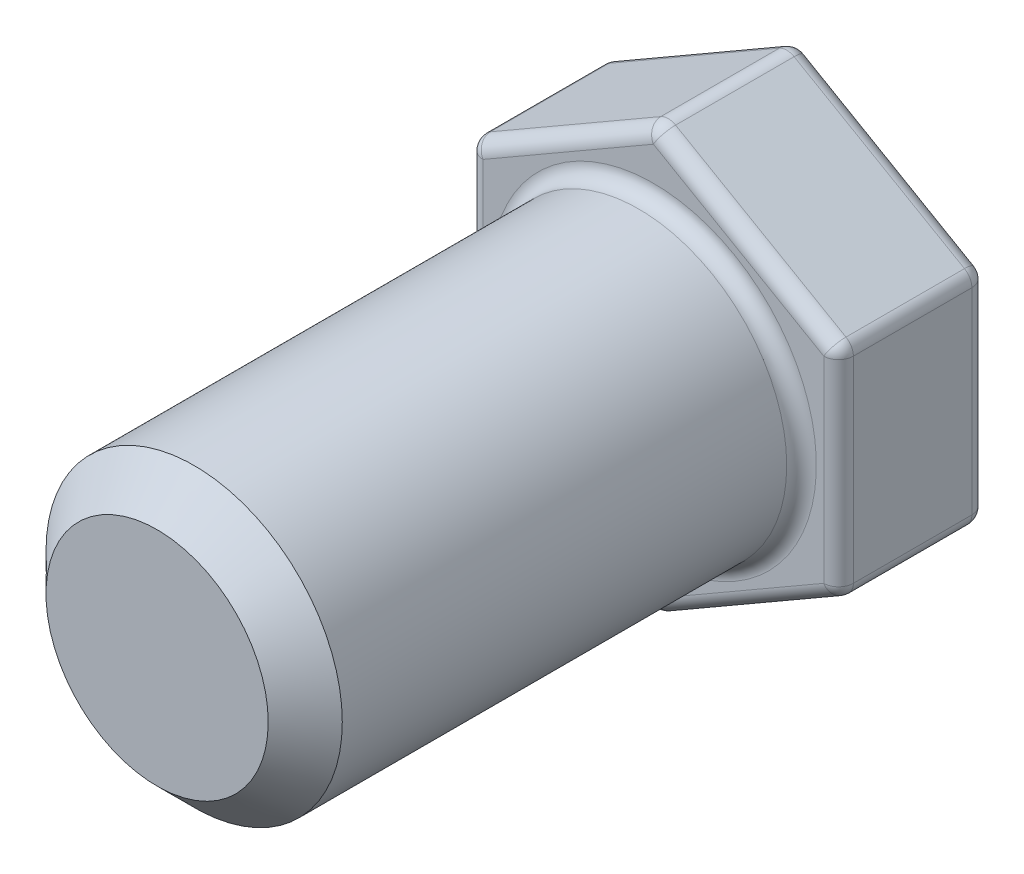
ISO-10303-21;
HEADER;
FILE_DESCRIPTION(('STEP AP214'),'2;1');
FILE_NAME('part.step','',(''),(''),'','','');
FILE_SCHEMA(('AUTOMOTIVE_DESIGN { 1 0 10303 214 1 1 1 1 }'));
ENDSEC;
DATA;
#1=APPLICATION_CONTEXT('core data for automotive mechanical design processes');
#2=APPLICATION_PROTOCOL_DEFINITION('international standard','automotive_design',2000,#1);
#3=PRODUCT_CONTEXT('',#1,'mechanical');
#4=PRODUCT('Part','Part','',(#3));
#5=PRODUCT_RELATED_PRODUCT_CATEGORY('part','',(#4));
#6=PRODUCT_DEFINITION_FORMATION('','',#4);
#7=PRODUCT_DEFINITION_CONTEXT('part definition',#1,'design');
#8=PRODUCT_DEFINITION('design','',#6,#7);
#9=PRODUCT_DEFINITION_SHAPE('','',#8);
#10=(LENGTH_UNIT() NAMED_UNIT(*) SI_UNIT(.MILLI.,.METRE.));
#11=(NAMED_UNIT(*) PLANE_ANGLE_UNIT() SI_UNIT($,.RADIAN.));
#12=(NAMED_UNIT(*) SI_UNIT($,.STERADIAN.) SOLID_ANGLE_UNIT());
#13=UNCERTAINTY_MEASURE_WITH_UNIT(LENGTH_MEASURE(1.E-05),#10,'distance_accuracy_value','');
#14=(GEOMETRIC_REPRESENTATION_CONTEXT(3) GLOBAL_UNCERTAINTY_ASSIGNED_CONTEXT((#13)) GLOBAL_UNIT_ASSIGNED_CONTEXT((#10,
#11,#12)) REPRESENTATION_CONTEXT('',''));
#15=CARTESIAN_POINT('',(0.,0.,0.));
#16=DIRECTION('',(0.,0.,1.));
#17=DIRECTION('',(1.,0.,0.));
#18=AXIS2_PLACEMENT_3D('',#15,#16,#17);
#19=CARTESIAN_POINT('',(0.,0.,6.7));
#20=DIRECTION('',(0.,0.,-1.));
#21=DIRECTION('',(-1.,0.,0.));
#22=AXIS2_PLACEMENT_3D('',#19,#20,#21);
#23=CYLINDRICAL_SURFACE('',#22,2.);
#24=CARTESIAN_POINT('',(0.,0.,6.2));
#25=DIRECTION('',(0.,0.,1.));
#26=DIRECTION('',(1.,0.,0.));
#27=AXIS2_PLACEMENT_3D('',#24,#25,#26);
#28=CIRCLE('',#27,2.);
#29=CARTESIAN_POINT('',(2.,0.,6.2));
#30=VERTEX_POINT('',#29);
#31=EDGE_CURVE('E11',#30,#30,#28,.F.);
#32=ORIENTED_EDGE('',*,*,#31,.T.);
#33=EDGE_LOOP('',(#32));
#34=FACE_BOUND('',#33,.T.);
#35=CARTESIAN_POINT('',(0.,0.,0.2));
#36=DIRECTION('',(0.,0.,-1.));
#37=DIRECTION('',(-1.,0.,0.));
#38=AXIS2_PLACEMENT_3D('',#35,#36,#37);
#39=CIRCLE('',#38,2.);
#40=CARTESIAN_POINT('',(-2.,0.,0.2));
#41=VERTEX_POINT('',#40);
#42=EDGE_CURVE('E290',#41,#41,#39,.F.);
#43=ORIENTED_EDGE('',*,*,#42,.T.);
#44=EDGE_LOOP('',(#43));
#45=FACE_BOUND('',#44,.T.);
#46=ADVANCED_FACE('F40',(#34,#45),#23,.T.);
#47=CARTESIAN_POINT('',(0.,0.,6.7));
#48=DIRECTION('',(0.,0.,1.));
#49=DIRECTION('',(1.,0.,0.));
#50=AXIS2_PLACEMENT_3D('',#47,#48,#49);
#51=PLANE('',#50);
#52=CARTESIAN_POINT('',(0.,0.,6.7));
#53=DIRECTION('',(0.,0.,1.));
#54=DIRECTION('',(1.,0.,0.));
#55=AXIS2_PLACEMENT_3D('',#52,#53,#54);
#56=CIRCLE('',#55,1.5);
#57=CARTESIAN_POINT('',(1.5,0.,6.7));
#58=VERTEX_POINT('',#57);
#59=EDGE_CURVE('E49',#58,#58,#56,.T.);
#60=ORIENTED_EDGE('',*,*,#59,.T.);
#61=EDGE_LOOP('',(#60));
#62=FACE_BOUND('',#61,.T.);
#63=ADVANCED_FACE('F439',(#62),#51,.T.);
#64=CARTESIAN_POINT('',(0.,2.88675134594813,-2.));
#65=DIRECTION('',(-0.500000000000001,-0.866025403784438,0.));
#66=DIRECTION('',(0.866025403784438,-0.500000000000001,0.));
#67=AXIS2_PLACEMENT_3D('',#64,#65,#66);
#68=PLANE('',#67);
#69=DIRECTION('',(0.866025403784438,-0.500000000000001,0.));
#70=VECTOR('',#69,1.);
#71=CARTESIAN_POINT('',(0.,2.88675134594813,-1.8));
#72=LINE('',#71,#70);
#73=CARTESIAN_POINT('',(2.4,1.50111069989303,-1.8));
#74=VERTEX_POINT('',#73);
#75=CARTESIAN_POINT('',(0.100000000000001,2.82901631902917,-1.8));
#76=VERTEX_POINT('',#75);
#77=EDGE_CURVE('E259',#74,#76,#72,.F.);
#78=ORIENTED_EDGE('',*,*,#77,.T.);
#79=DIRECTION('',(0.,0.,1.));
#80=VECTOR('',#79,1.);
#81=CARTESIAN_POINT('',(0.100000000000001,2.82901631902917,-2.));
#82=LINE('',#81,#80);
#83=CARTESIAN_POINT('',(0.100000000000001,2.82901631902917,-0.2));
#84=VERTEX_POINT('',#83);
#85=EDGE_CURVE('E362',#76,#84,#82,.T.);
#86=ORIENTED_EDGE('',*,*,#85,.T.);
#87=DIRECTION('',(0.866025403784438,-0.500000000000001,0.));
#88=VECTOR('',#87,1.);
#89=CARTESIAN_POINT('',(0.,2.88675134594813,-0.2));
#90=LINE('',#89,#88);
#91=CARTESIAN_POINT('',(2.4,1.50111069989303,-0.2));
#92=VERTEX_POINT('',#91);
#93=EDGE_CURVE('E255',#84,#92,#90,.T.);
#94=ORIENTED_EDGE('',*,*,#93,.T.);
#95=DIRECTION('',(0.,0.,1.));
#96=VECTOR('',#95,1.);
#97=CARTESIAN_POINT('',(2.4,1.50111069989303,-2.));
#98=LINE('',#97,#96);
#99=EDGE_CURVE('E359',#92,#74,#98,.F.);
#100=ORIENTED_EDGE('',*,*,#99,.T.);
#101=EDGE_LOOP('',(#78,#86,#94,#100));
#102=FACE_BOUND('',#101,.T.);
#103=ADVANCED_FACE('F457',(#102),#68,.F.);
#104=CARTESIAN_POINT('',(2.5,1.44337567297406,-2.));
#105=DIRECTION('',(-1.,0.,0.));
#106=DIRECTION('',(0.,0.,1.));
#107=AXIS2_PLACEMENT_3D('',#104,#105,#106);
#108=PLANE('',#107);
#109=DIRECTION('',(0.,-1.,0.));
#110=VECTOR('',#109,1.);
#111=CARTESIAN_POINT('',(2.5,1.44337567297406,-0.2));
#112=LINE('',#111,#110);
#113=CARTESIAN_POINT('',(2.5,1.32790561913614,-0.2));
#114=VERTEX_POINT('',#113);
#115=CARTESIAN_POINT('',(2.5,-1.32790561913614,-0.2));
#116=VERTEX_POINT('',#115);
#117=EDGE_CURVE('E249',#114,#116,#112,.T.);
#118=ORIENTED_EDGE('',*,*,#117,.T.);
#119=DIRECTION('',(0.,0.,1.));
#120=VECTOR('',#119,1.);
#121=CARTESIAN_POINT('',(2.5,-1.32790561913614,-2.));
#122=LINE('',#121,#120);
#123=CARTESIAN_POINT('',(2.5,-1.32790561913614,-1.8));
#124=VERTEX_POINT('',#123);
#125=EDGE_CURVE('E391',#116,#124,#122,.F.);
#126=ORIENTED_EDGE('',*,*,#125,.T.);
#127=DIRECTION('',(0.,-1.,0.));
#128=VECTOR('',#127,1.);
#129=CARTESIAN_POINT('',(2.5,1.44337567297406,-1.8));
#130=LINE('',#129,#128);
#131=CARTESIAN_POINT('',(2.5,1.32790561913614,-1.8));
#132=VERTEX_POINT('',#131);
#133=EDGE_CURVE('E252',#124,#132,#130,.F.);
#134=ORIENTED_EDGE('',*,*,#133,.T.);
#135=DIRECTION('',(0.,0.,1.));
#136=VECTOR('',#135,1.);
#137=CARTESIAN_POINT('',(2.5,1.32790561913614,-2.));
#138=LINE('',#137,#136);
#139=EDGE_CURVE('E63',#132,#114,#138,.T.);
#140=ORIENTED_EDGE('',*,*,#139,.T.);
#141=EDGE_LOOP('',(#118,#126,#134,#140));
#142=FACE_BOUND('',#141,.T.);
#143=ADVANCED_FACE('F623',(#142),#108,.F.);
#144=CARTESIAN_POINT('',(2.5,-1.44337567297406,-2.));
#145=DIRECTION('',(-0.5,0.866025403784439,0.));
#146=DIRECTION('',(-0.866025403784439,-0.5,0.));
#147=AXIS2_PLACEMENT_3D('',#144,#145,#146);
#148=PLANE('',#147);
#149=DIRECTION('',(-0.866025403784439,-0.5,0.));
#150=VECTOR('',#149,1.);
#151=CARTESIAN_POINT('',(2.5,-1.44337567297406,-0.2));
#152=LINE('',#151,#150);
#153=CARTESIAN_POINT('',(2.4,-1.50111069989303,-0.2));
#154=VERTEX_POINT('',#153);
#155=CARTESIAN_POINT('',(0.099999999999999,-2.82901631902917,-0.2));
#156=VERTEX_POINT('',#155);
#157=EDGE_CURVE('E241',#154,#156,#152,.T.);
#158=ORIENTED_EDGE('',*,*,#157,.T.);
#159=DIRECTION('',(0.,0.,1.));
#160=VECTOR('',#159,1.);
#161=CARTESIAN_POINT('',(0.1,-2.82901631902917,-2.));
#162=LINE('',#161,#160);
#163=CARTESIAN_POINT('',(0.099999999999999,-2.82901631902917,-1.8));
#164=VERTEX_POINT('',#163);
#165=EDGE_CURVE('E386',#156,#164,#162,.F.);
#166=ORIENTED_EDGE('',*,*,#165,.T.);
#167=DIRECTION('',(-0.866025403784439,-0.5,0.));
#168=VECTOR('',#167,1.);
#169=CARTESIAN_POINT('',(2.5,-1.44337567297406,-1.8));
#170=LINE('',#169,#168);
#171=CARTESIAN_POINT('',(2.4,-1.50111069989303,-1.8));
#172=VERTEX_POINT('',#171);
#173=EDGE_CURVE('E245',#164,#172,#170,.F.);
#174=ORIENTED_EDGE('',*,*,#173,.T.);
#175=DIRECTION('',(0.,0.,1.));
#176=VECTOR('',#175,1.);
#177=CARTESIAN_POINT('',(2.4,-1.50111069989303,-2.));
#178=LINE('',#177,#176);
#179=EDGE_CURVE('E383',#172,#154,#178,.T.);
#180=ORIENTED_EDGE('',*,*,#179,.T.);
#181=EDGE_LOOP('',(#158,#166,#174,#180));
#182=FACE_BOUND('',#181,.T.);
#183=ADVANCED_FACE('F619',(#182),#148,.F.);
#184=CARTESIAN_POINT('',(0.,-2.88675134594813,-2.));
#185=DIRECTION('',(0.5,0.866025403784438,0.));
#186=DIRECTION('',(-0.866025403784438,0.5,0.));
#187=AXIS2_PLACEMENT_3D('',#184,#185,#186);
#188=PLANE('',#187);
#189=DIRECTION('',(-0.866025403784438,0.5,0.));
#190=VECTOR('',#189,1.);
#191=CARTESIAN_POINT('',(0.,-2.88675134594813,-0.2));
#192=LINE('',#191,#190);
#193=CARTESIAN_POINT('',(-0.0999999999999999,-2.82901631902917,-0.2));
#194=VERTEX_POINT('',#193);
#195=CARTESIAN_POINT('',(-2.4,-1.50111069989303,-0.2));
#196=VERTEX_POINT('',#195);
#197=EDGE_CURVE('E233',#194,#196,#192,.T.);
#198=ORIENTED_EDGE('',*,*,#197,.T.);
#199=DIRECTION('',(0.,0.,1.));
#200=VECTOR('',#199,1.);
#201=CARTESIAN_POINT('',(-2.4,-1.50111069989303,-2.));
#202=LINE('',#201,#200);
#203=CARTESIAN_POINT('',(-2.4,-1.50111069989303,-1.8));
#204=VERTEX_POINT('',#203);
#205=EDGE_CURVE('E380',#196,#204,#202,.F.);
#206=ORIENTED_EDGE('',*,*,#205,.T.);
#207=DIRECTION('',(-0.866025403784438,0.5,0.));
#208=VECTOR('',#207,1.);
#209=CARTESIAN_POINT('',(0.,-2.88675134594813,-1.8));
#210=LINE('',#209,#208);
#211=CARTESIAN_POINT('',(-0.0999999999999998,-2.82901631902917,-1.8));
#212=VERTEX_POINT('',#211);
#213=EDGE_CURVE('E237',#204,#212,#210,.F.);
#214=ORIENTED_EDGE('',*,*,#213,.T.);
#215=DIRECTION('',(0.,0.,1.));
#216=VECTOR('',#215,1.);
#217=CARTESIAN_POINT('',(-0.0999999999999999,-2.82901631902917,-2.));
#218=LINE('',#217,#216);
#219=EDGE_CURVE('E377',#212,#194,#218,.T.);
#220=ORIENTED_EDGE('',*,*,#219,.T.);
#221=EDGE_LOOP('',(#198,#206,#214,#220));
#222=FACE_BOUND('',#221,.T.);
#223=ADVANCED_FACE('F613',(#222),#188,.F.);
#224=CARTESIAN_POINT('',(-2.5,-1.44337567297406,-2.));
#225=DIRECTION('',(1.,0.,0.));
#226=DIRECTION('',(0.,1.,0.));
#227=AXIS2_PLACEMENT_3D('',#224,#225,#226);
#228=PLANE('',#227);
#229=DIRECTION('',(0.,1.,0.));
#230=VECTOR('',#229,1.);
#231=CARTESIAN_POINT('',(-2.5,-1.44337567297406,-0.2));
#232=LINE('',#231,#230);
#233=CARTESIAN_POINT('',(-2.5,-1.32790561913614,-0.2));
#234=VERTEX_POINT('',#233);
#235=CARTESIAN_POINT('',(-2.5,1.32790561913614,-0.2));
#236=VERTEX_POINT('',#235);
#237=EDGE_CURVE('E225',#234,#236,#232,.T.);
#238=ORIENTED_EDGE('',*,*,#237,.T.);
#239=DIRECTION('',(0.,0.,1.));
#240=VECTOR('',#239,1.);
#241=CARTESIAN_POINT('',(-2.5,1.32790561913614,-2.));
#242=LINE('',#241,#240);
#243=CARTESIAN_POINT('',(-2.5,1.32790561913614,-1.8));
#244=VERTEX_POINT('',#243);
#245=EDGE_CURVE('E374',#236,#244,#242,.F.);
#246=ORIENTED_EDGE('',*,*,#245,.T.);
#247=DIRECTION('',(0.,1.,0.));
#248=VECTOR('',#247,1.);
#249=CARTESIAN_POINT('',(-2.5,-1.44337567297406,-1.8));
#250=LINE('',#249,#248);
#251=CARTESIAN_POINT('',(-2.5,-1.32790561913614,-1.8));
#252=VERTEX_POINT('',#251);
#253=EDGE_CURVE('E229',#244,#252,#250,.F.);
#254=ORIENTED_EDGE('',*,*,#253,.T.);
#255=DIRECTION('',(0.,0.,1.));
#256=VECTOR('',#255,1.);
#257=CARTESIAN_POINT('',(-2.5,-1.32790561913614,-2.));
#258=LINE('',#257,#256);
#259=EDGE_CURVE('E371',#252,#234,#258,.T.);
#260=ORIENTED_EDGE('',*,*,#259,.T.);
#261=EDGE_LOOP('',(#238,#246,#254,#260));
#262=FACE_BOUND('',#261,.T.);
#263=ADVANCED_FACE('F600',(#262),#228,.F.);
#264=CARTESIAN_POINT('',(-2.5,1.44337567297407,-2.));
#265=DIRECTION('',(0.5,-0.866025403784439,0.));
#266=DIRECTION('',(0.866025403784439,0.5,0.));
#267=AXIS2_PLACEMENT_3D('',#264,#265,#266);
#268=PLANE('',#267);
#269=DIRECTION('',(0.866025403784439,0.5,0.));
#270=VECTOR('',#269,1.);
#271=CARTESIAN_POINT('',(-2.5,1.44337567297407,-0.2));
#272=LINE('',#271,#270);
#273=CARTESIAN_POINT('',(-2.4,1.50111069989303,-0.2));
#274=VERTEX_POINT('',#273);
#275=CARTESIAN_POINT('',(-0.099999999999999,2.82901631902917,-0.2));
#276=VERTEX_POINT('',#275);
#277=EDGE_CURVE('E213',#274,#276,#272,.T.);
#278=ORIENTED_EDGE('',*,*,#277,.T.);
#279=DIRECTION('',(0.,0.,1.));
#280=VECTOR('',#279,1.);
#281=CARTESIAN_POINT('',(-0.0999999999999994,2.82901631902917,-2.));
#282=LINE('',#281,#280);
#283=CARTESIAN_POINT('',(-0.0999999999999985,2.82901631902917,-1.8));
#284=VERTEX_POINT('',#283);
#285=EDGE_CURVE('E368',#276,#284,#282,.F.);
#286=ORIENTED_EDGE('',*,*,#285,.T.);
#287=DIRECTION('',(0.866025403784439,0.5,0.));
#288=VECTOR('',#287,1.);
#289=CARTESIAN_POINT('',(-2.5,1.44337567297407,-1.8));
#290=LINE('',#289,#288);
#291=CARTESIAN_POINT('',(-2.4,1.50111069989303,-1.8));
#292=VERTEX_POINT('',#291);
#293=EDGE_CURVE('E191',#284,#292,#290,.F.);
#294=ORIENTED_EDGE('',*,*,#293,.T.);
#295=DIRECTION('',(0.,0.,1.));
#296=VECTOR('',#295,1.);
#297=CARTESIAN_POINT('',(-2.4,1.50111069989303,-2.));
#298=LINE('',#297,#296);
#299=EDGE_CURVE('E365',#292,#274,#298,.T.);
#300=ORIENTED_EDGE('',*,*,#299,.T.);
#301=EDGE_LOOP('',(#278,#286,#294,#300));
#302=FACE_BOUND('',#301,.T.);
#303=ADVANCED_FACE('F605',(#302),#268,.F.);
#304=CARTESIAN_POINT('',(0.,0.,-2.));
#305=DIRECTION('',(0.,0.,-1.));
#306=DIRECTION('',(-1.,0.,0.));
#307=AXIS2_PLACEMENT_3D('',#304,#305,#306);
#308=PLANE('',#307);
#309=DIRECTION('',(0.,1.,0.));
#310=VECTOR('',#309,1.);
#311=CARTESIAN_POINT('',(-2.3,1.44337567297407,-2.));
#312=LINE('',#311,#310);
#313=CARTESIAN_POINT('',(-2.3,-1.32790561913614,-2.));
#314=VERTEX_POINT('',#313);
#315=CARTESIAN_POINT('',(-2.3,1.32790561913614,-2.));
#316=VERTEX_POINT('',#315);
#317=EDGE_CURVE('E211',#314,#316,#312,.T.);
#318=ORIENTED_EDGE('',*,*,#317,.T.);
#319=DIRECTION('',(0.866025403784439,0.5,0.));
#320=VECTOR('',#319,1.);
#321=CARTESIAN_POINT('',(0.100000000000001,2.71354626519124,-2.));
#322=LINE('',#321,#320);
#323=CARTESIAN_POINT('',(0.,2.65581123827228,-2.));
#324=VERTEX_POINT('',#323);
#325=EDGE_CURVE('E188',#316,#324,#322,.T.);
#326=ORIENTED_EDGE('',*,*,#325,.T.);
#327=DIRECTION('',(0.866025403784438,-0.500000000000001,0.));
#328=VECTOR('',#327,1.);
#329=CARTESIAN_POINT('',(2.4,1.27017059221718,-2.));
#330=LINE('',#329,#328);
#331=CARTESIAN_POINT('',(2.3,1.32790561913614,-2.));
#332=VERTEX_POINT('',#331);
#333=EDGE_CURVE('E197',#324,#332,#330,.T.);
#334=ORIENTED_EDGE('',*,*,#333,.T.);
#335=DIRECTION('',(0.,-1.,0.));
#336=VECTOR('',#335,1.);
#337=CARTESIAN_POINT('',(2.3,-1.44337567297406,-2.));
#338=LINE('',#337,#336);
#339=CARTESIAN_POINT('',(2.3,-1.32790561913614,-2.));
#340=VERTEX_POINT('',#339);
#341=EDGE_CURVE('E204',#332,#340,#338,.T.);
#342=ORIENTED_EDGE('',*,*,#341,.T.);
#343=DIRECTION('',(-0.866025403784439,-0.5,0.));
#344=VECTOR('',#343,1.);
#345=CARTESIAN_POINT('',(-0.1,-2.71354626519124,-2.));
#346=LINE('',#345,#344);
#347=CARTESIAN_POINT('',(0.,-2.65581123827228,-2.));
#348=VERTEX_POINT('',#347);
#349=EDGE_CURVE('E905',#340,#348,#346,.T.);
#350=ORIENTED_EDGE('',*,*,#349,.T.);
#351=DIRECTION('',(-0.866025403784438,0.5,0.));
#352=VECTOR('',#351,1.);
#353=CARTESIAN_POINT('',(-2.4,-1.27017059221718,-2.));
#354=LINE('',#353,#352);
#355=EDGE_CURVE('E219',#348,#314,#354,.T.);
#356=ORIENTED_EDGE('',*,*,#355,.T.);
#357=EDGE_LOOP('',(#318,#326,#334,#342,#350,#356));
#358=FACE_BOUND('',#357,.T.);
#359=ADVANCED_FACE('F208',(#358),#308,.T.);
#360=CARTESIAN_POINT('',(0.,0.,0.));
#361=DIRECTION('',(0.,0.,-1.));
#362=DIRECTION('',(-1.,0.,0.));
#363=AXIS2_PLACEMENT_3D('',#360,#361,#362);
#364=PLANE('',#363);
#365=DIRECTION('',(-0.866025403784439,-0.5,0.));
#366=VECTOR('',#365,1.);
#367=CARTESIAN_POINT('',(1.15,-1.99185842870421,0.));
#368=LINE('',#367,#366);
#369=CARTESIAN_POINT('',(0.,-2.65581123827228,0.));
#370=VERTEX_POINT('',#369);
#371=CARTESIAN_POINT('',(2.3,-1.32790561913614,0.));
#372=VERTEX_POINT('',#371);
#373=EDGE_CURVE('E282',#370,#372,#368,.F.);
#374=ORIENTED_EDGE('',*,*,#373,.T.);
#375=DIRECTION('',(0.,-1.,0.));
#376=VECTOR('',#375,1.);
#377=CARTESIAN_POINT('',(2.3,0.,0.));
#378=LINE('',#377,#376);
#379=CARTESIAN_POINT('',(2.3,1.32790561913614,0.));
#380=VERTEX_POINT('',#379);
#381=EDGE_CURVE('E286',#372,#380,#378,.F.);
#382=ORIENTED_EDGE('',*,*,#381,.T.);
#383=DIRECTION('',(0.866025403784438,-0.500000000000001,0.));
#384=VECTOR('',#383,1.);
#385=CARTESIAN_POINT('',(1.15,1.99185842870421,0.));
#386=LINE('',#385,#384);
#387=CARTESIAN_POINT('',(0.,2.65581123827228,0.));
#388=VERTEX_POINT('',#387);
#389=EDGE_CURVE('E266',#380,#388,#386,.F.);
#390=ORIENTED_EDGE('',*,*,#389,.T.);
#391=DIRECTION('',(0.866025403784439,0.5,0.));
#392=VECTOR('',#391,1.);
#393=CARTESIAN_POINT('',(-1.15,1.99185842870421,0.));
#394=LINE('',#393,#392);
#395=CARTESIAN_POINT('',(-2.3,1.32790561913614,0.));
#396=VERTEX_POINT('',#395);
#397=EDGE_CURVE('E270',#388,#396,#394,.F.);
#398=ORIENTED_EDGE('',*,*,#397,.T.);
#399=DIRECTION('',(0.,1.,0.));
#400=VECTOR('',#399,1.);
#401=CARTESIAN_POINT('',(-2.3,0.,0.));
#402=LINE('',#401,#400);
#403=CARTESIAN_POINT('',(-2.3,-1.32790561913614,0.));
#404=VERTEX_POINT('',#403);
#405=EDGE_CURVE('E274',#396,#404,#402,.F.);
#406=ORIENTED_EDGE('',*,*,#405,.T.);
#407=DIRECTION('',(-0.866025403784438,0.5,0.));
#408=VECTOR('',#407,1.);
#409=CARTESIAN_POINT('',(-1.15,-1.99185842870421,0.));
#410=LINE('',#409,#408);
#411=EDGE_CURVE('E278',#404,#370,#410,.F.);
#412=ORIENTED_EDGE('',*,*,#411,.T.);
#413=EDGE_LOOP('',(#374,#382,#390,#398,#406,#412));
#414=FACE_BOUND('',#413,.T.);
#415=CARTESIAN_POINT('',(0.,0.,0.));
#416=DIRECTION('',(0.,0.,-1.));
#417=DIRECTION('',(-1.,0.,0.));
#418=AXIS2_PLACEMENT_3D('',#415,#416,#417);
#419=CIRCLE('',#418,2.2);
#420=CARTESIAN_POINT('',(-2.2,0.,0.));
#421=VERTEX_POINT('',#420);
#422=EDGE_CURVE('E262',#421,#421,#419,.T.);
#423=ORIENTED_EDGE('',*,*,#422,.T.);
#424=EDGE_LOOP('',(#423));
#425=FACE_BOUND('',#424,.T.);
#426=ADVANCED_FACE('F482',(#414,#425),#364,.F.);
#427=CARTESIAN_POINT('',(1.15,-1.99185842870421,-1.8));
#428=DIRECTION('',(0.866025403784439,0.5,0.));
#429=DIRECTION('',(-0.5,0.866025403784439,0.));
#430=AXIS2_PLACEMENT_3D('',#427,#428,#429);
#431=CYLINDRICAL_SURFACE('',#430,0.2);
#432=ORIENTED_EDGE('',*,*,#173,.F.);
#433=CARTESIAN_POINT('',(0.,-2.65581123827228,-1.8));
#434=DIRECTION('',(0.866025403784439,0.5,0.));
#435=DIRECTION('',(-0.5,0.866025403784439,0.));
#436=AXIS2_PLACEMENT_3D('',#433,#434,#435);
#437=CIRCLE('',#436,0.2);
#438=EDGE_CURVE('E338',#164,#348,#437,.T.);
#439=ORIENTED_EDGE('',*,*,#438,.T.);
#440=ORIENTED_EDGE('',*,*,#349,.F.);
#441=CARTESIAN_POINT('',(2.3,-1.32790561913614,-1.8));
#442=DIRECTION('',(0.866025403784439,0.5,0.));
#443=DIRECTION('',(-0.5,0.866025403784439,0.));
#444=AXIS2_PLACEMENT_3D('',#441,#442,#443);
#445=CIRCLE('',#444,0.2);
#446=EDGE_CURVE('E335',#340,#172,#445,.F.);
#447=ORIENTED_EDGE('',*,*,#446,.T.);
#448=EDGE_LOOP('',(#432,#439,#440,#447));
#449=FACE_BOUND('',#448,.T.);
#450=ADVANCED_FACE('F478',(#449),#431,.T.);
#451=CARTESIAN_POINT('',(-1.15,-1.99185842870421,-1.8));
#452=DIRECTION('',(0.866025403784438,-0.5,0.));
#453=DIRECTION('',(0.5,0.866025403784438,0.));
#454=AXIS2_PLACEMENT_3D('',#451,#452,#453);
#455=CYLINDRICAL_SURFACE('',#454,0.2);
#456=ORIENTED_EDGE('',*,*,#213,.F.);
#457=CARTESIAN_POINT('',(-2.3,-1.32790561913614,-1.8));
#458=DIRECTION('',(0.866025403784438,-0.5,0.));
#459=DIRECTION('',(0.5,0.866025403784438,0.));
#460=AXIS2_PLACEMENT_3D('',#457,#458,#459);
#461=CIRCLE('',#460,0.2);
#462=EDGE_CURVE('E326',#204,#314,#461,.T.);
#463=ORIENTED_EDGE('',*,*,#462,.T.);
#464=ORIENTED_EDGE('',*,*,#355,.F.);
#465=CARTESIAN_POINT('',(0.,-2.65581123827228,-1.8));
#466=DIRECTION('',(0.866025403784438,-0.5,0.));
#467=DIRECTION('',(0.5,0.866025403784438,0.));
#468=AXIS2_PLACEMENT_3D('',#465,#466,#467);
#469=CIRCLE('',#468,0.2);
#470=EDGE_CURVE('E322',#348,#212,#469,.F.);
#471=ORIENTED_EDGE('',*,*,#470,.T.);
#472=EDGE_LOOP('',(#456,#463,#464,#471));
#473=FACE_BOUND('',#472,.T.);
#474=ADVANCED_FACE('F474',(#473),#455,.T.);
#475=CARTESIAN_POINT('',(2.3,0.,-1.8));
#476=DIRECTION('',(0.,1.,0.));
#477=DIRECTION('',(0.,0.,1.));
#478=AXIS2_PLACEMENT_3D('',#475,#476,#477);
#479=CYLINDRICAL_SURFACE('',#478,0.2);
#480=ORIENTED_EDGE('',*,*,#133,.F.);
#481=CARTESIAN_POINT('',(2.3,-1.32790561913614,-1.8));
#482=DIRECTION('',(0.,1.,0.));
#483=DIRECTION('',(0.,0.,1.));
#484=AXIS2_PLACEMENT_3D('',#481,#482,#483);
#485=CIRCLE('',#484,0.2);
#486=EDGE_CURVE('E350',#124,#340,#485,.T.);
#487=ORIENTED_EDGE('',*,*,#486,.T.);
#488=ORIENTED_EDGE('',*,*,#341,.F.);
#489=CARTESIAN_POINT('',(2.3,1.32790561913614,-1.8));
#490=DIRECTION('',(0.,1.,0.));
#491=DIRECTION('',(0.,0.,1.));
#492=AXIS2_PLACEMENT_3D('',#489,#490,#491);
#493=CIRCLE('',#492,0.2);
#494=EDGE_CURVE('E347',#332,#132,#493,.F.);
#495=ORIENTED_EDGE('',*,*,#494,.T.);
#496=EDGE_LOOP('',(#480,#487,#488,#495));
#497=FACE_BOUND('',#496,.T.);
#498=ADVANCED_FACE('F470',(#497),#479,.T.);
#499=CARTESIAN_POINT('',(-2.3,0.,-1.8));
#500=DIRECTION('',(0.,-1.,0.));
#501=DIRECTION('',(1.,0.,0.));
#502=AXIS2_PLACEMENT_3D('',#499,#500,#501);
#503=CYLINDRICAL_SURFACE('',#502,0.2);
#504=ORIENTED_EDGE('',*,*,#253,.F.);
#505=CARTESIAN_POINT('',(-2.3,1.32790561913614,-1.8));
#506=DIRECTION('',(0.,-1.,0.));
#507=DIRECTION('',(1.,0.,0.));
#508=AXIS2_PLACEMENT_3D('',#505,#506,#507);
#509=CIRCLE('',#508,0.2);
#510=EDGE_CURVE('E313',#244,#316,#509,.T.);
#511=ORIENTED_EDGE('',*,*,#510,.T.);
#512=ORIENTED_EDGE('',*,*,#317,.F.);
#513=CARTESIAN_POINT('',(-2.3,-1.32790561913614,-1.8));
#514=DIRECTION('',(0.,-1.,0.));
#515=DIRECTION('',(1.,0.,0.));
#516=AXIS2_PLACEMENT_3D('',#513,#514,#515);
#517=CIRCLE('',#516,0.2);
#518=EDGE_CURVE('E309',#314,#252,#517,.F.);
#519=ORIENTED_EDGE('',*,*,#518,.T.);
#520=EDGE_LOOP('',(#504,#511,#512,#519));
#521=FACE_BOUND('',#520,.T.);
#522=ADVANCED_FACE('F467',(#521),#503,.T.);
#523=CARTESIAN_POINT('',(1.15,1.99185842870421,-1.8));
#524=DIRECTION('',(-0.866025403784438,0.500000000000001,0.));
#525=DIRECTION('',(-0.500000000000001,-0.866025403784438,0.));
#526=AXIS2_PLACEMENT_3D('',#523,#524,#525);
#527=CYLINDRICAL_SURFACE('',#526,0.2);
#528=ORIENTED_EDGE('',*,*,#333,.F.);
#529=CARTESIAN_POINT('',(0.,2.65581123827228,-1.8));
#530=DIRECTION('',(-0.866025403784438,0.500000000000001,0.));
#531=DIRECTION('',(-0.500000000000001,-0.866025403784438,0.));
#532=AXIS2_PLACEMENT_3D('',#529,#530,#531);
#533=CIRCLE('',#532,0.2);
#534=EDGE_CURVE('E168',#324,#76,#533,.F.);
#535=ORIENTED_EDGE('',*,*,#534,.T.);
#536=ORIENTED_EDGE('',*,*,#77,.F.);
#537=CARTESIAN_POINT('',(2.3,1.32790561913614,-1.8));
#538=DIRECTION('',(-0.866025403784438,0.500000000000001,0.));
#539=DIRECTION('',(-0.500000000000001,-0.866025403784438,0.));
#540=AXIS2_PLACEMENT_3D('',#537,#538,#539);
#541=CIRCLE('',#540,0.2);
#542=EDGE_CURVE('E180',#74,#332,#541,.T.);
#543=ORIENTED_EDGE('',*,*,#542,.T.);
#544=EDGE_LOOP('',(#528,#535,#536,#543));
#545=FACE_BOUND('',#544,.T.);
#546=ADVANCED_FACE('F198',(#545),#527,.T.);
#547=CARTESIAN_POINT('',(-1.15,1.99185842870421,-1.8));
#548=DIRECTION('',(-0.866025403784439,-0.5,0.));
#549=DIRECTION('',(0.5,-0.866025403784439,0.));
#550=AXIS2_PLACEMENT_3D('',#547,#548,#549);
#551=CYLINDRICAL_SURFACE('',#550,0.2);
#552=ORIENTED_EDGE('',*,*,#293,.F.);
#553=CARTESIAN_POINT('',(0.,2.65581123827228,-1.8));
#554=DIRECTION('',(-0.866025403784439,-0.5,0.));
#555=DIRECTION('',(0.5,-0.866025403784439,0.));
#556=AXIS2_PLACEMENT_3D('',#553,#554,#555);
#557=CIRCLE('',#556,0.2);
#558=EDGE_CURVE('E171',#284,#324,#557,.T.);
#559=ORIENTED_EDGE('',*,*,#558,.T.);
#560=ORIENTED_EDGE('',*,*,#325,.F.);
#561=CARTESIAN_POINT('',(-2.3,1.32790561913614,-1.8));
#562=DIRECTION('',(-0.866025403784439,-0.5,0.));
#563=DIRECTION('',(0.5,-0.866025403784439,0.));
#564=AXIS2_PLACEMENT_3D('',#561,#562,#563);
#565=CIRCLE('',#564,0.2);
#566=EDGE_CURVE('E193',#316,#292,#565,.F.);
#567=ORIENTED_EDGE('',*,*,#566,.T.);
#568=EDGE_LOOP('',(#552,#559,#560,#567));
#569=FACE_BOUND('',#568,.T.);
#570=ADVANCED_FACE('F185',(#569),#551,.T.);
#571=CARTESIAN_POINT('',(-2.3,-1.44337567297406,-0.2));
#572=DIRECTION('',(0.,1.,0.));
#573=DIRECTION('',(-1.,0.,0.));
#574=AXIS2_PLACEMENT_3D('',#571,#572,#573);
#575=CYLINDRICAL_SURFACE('',#574,0.2);
#576=ORIENTED_EDGE('',*,*,#405,.F.);
#577=CARTESIAN_POINT('',(-2.3,1.32790561913614,-0.2));
#578=DIRECTION('',(0.,1.,0.));
#579=DIRECTION('',(-1.,0.,0.));
#580=AXIS2_PLACEMENT_3D('',#577,#578,#579);
#581=CIRCLE('',#580,0.2);
#582=EDGE_CURVE('E319',#396,#236,#581,.F.);
#583=ORIENTED_EDGE('',*,*,#582,.T.);
#584=ORIENTED_EDGE('',*,*,#237,.F.);
#585=CARTESIAN_POINT('',(-2.3,-1.32790561913614,-0.2));
#586=DIRECTION('',(0.,1.,0.));
#587=DIRECTION('',(-1.,0.,0.));
#588=AXIS2_PLACEMENT_3D('',#585,#586,#587);
#589=CIRCLE('',#588,0.2);
#590=EDGE_CURVE('E316',#234,#404,#589,.T.);
#591=ORIENTED_EDGE('',*,*,#590,.T.);
#592=EDGE_LOOP('',(#576,#583,#584,#591));
#593=FACE_BOUND('',#592,.T.);
#594=ADVANCED_FACE('F464',(#593),#575,.T.);
#595=CARTESIAN_POINT('',(-2.4,1.27017059221718,-0.2));
#596=DIRECTION('',(0.866025403784439,0.5,0.));
#597=DIRECTION('',(-0.5,0.866025403784439,0.));
#598=AXIS2_PLACEMENT_3D('',#595,#596,#597);
#599=CYLINDRICAL_SURFACE('',#598,0.2);
#600=ORIENTED_EDGE('',*,*,#397,.F.);
#601=CARTESIAN_POINT('',(0.,2.65581123827228,-0.2));
#602=DIRECTION('',(0.866025403784439,0.5,0.));
#603=DIRECTION('',(-0.5,0.866025403784439,0.));
#604=AXIS2_PLACEMENT_3D('',#601,#602,#603);
#605=CIRCLE('',#604,0.2);
#606=EDGE_CURVE('E306',#388,#276,#605,.F.);
#607=ORIENTED_EDGE('',*,*,#606,.T.);
#608=ORIENTED_EDGE('',*,*,#277,.F.);
#609=CARTESIAN_POINT('',(-2.3,1.32790561913614,-0.2));
#610=DIRECTION('',(0.866025403784439,0.5,0.));
#611=DIRECTION('',(-0.5,0.866025403784439,0.));
#612=AXIS2_PLACEMENT_3D('',#609,#610,#611);
#613=CIRCLE('',#612,0.2);
#614=EDGE_CURVE('E303',#274,#396,#613,.T.);
#615=ORIENTED_EDGE('',*,*,#614,.T.);
#616=EDGE_LOOP('',(#600,#607,#608,#615));
#617=FACE_BOUND('',#616,.T.);
#618=ADVANCED_FACE('F499',(#617),#599,.T.);
#619=CARTESIAN_POINT('',(0.1,-2.71354626519124,-0.2));
#620=DIRECTION('',(-0.866025403784438,0.5,0.));
#621=DIRECTION('',(-0.5,-0.866025403784438,0.));
#622=AXIS2_PLACEMENT_3D('',#619,#620,#621);
#623=CYLINDRICAL_SURFACE('',#622,0.2);
#624=ORIENTED_EDGE('',*,*,#411,.F.);
#625=CARTESIAN_POINT('',(-2.3,-1.32790561913614,-0.2));
#626=DIRECTION('',(-0.866025403784438,0.5,0.));
#627=DIRECTION('',(-0.5,-0.866025403784438,0.));
#628=AXIS2_PLACEMENT_3D('',#625,#626,#627);
#629=CIRCLE('',#628,0.2);
#630=EDGE_CURVE('E332',#404,#196,#629,.F.);
#631=ORIENTED_EDGE('',*,*,#630,.T.);
#632=ORIENTED_EDGE('',*,*,#197,.F.);
#633=CARTESIAN_POINT('',(0.,-2.65581123827228,-0.2));
#634=DIRECTION('',(-0.866025403784438,0.5,0.));
#635=DIRECTION('',(-0.5,-0.866025403784438,0.));
#636=AXIS2_PLACEMENT_3D('',#633,#634,#635);
#637=CIRCLE('',#636,0.2);
#638=EDGE_CURVE('E329',#194,#370,#637,.T.);
#639=ORIENTED_EDGE('',*,*,#638,.T.);
#640=EDGE_LOOP('',(#624,#631,#632,#639));
#641=FACE_BOUND('',#640,.T.);
#642=ADVANCED_FACE('F495',(#641),#623,.T.);
#643=CARTESIAN_POINT('',(-0.0999999999999993,2.71354626519124,-0.2));
#644=DIRECTION('',(0.866025403784438,-0.500000000000001,0.));
#645=DIRECTION('',(0.500000000000001,0.866025403784438,0.));
#646=AXIS2_PLACEMENT_3D('',#643,#644,#645);
#647=CYLINDRICAL_SURFACE('',#646,0.2);
#648=ORIENTED_EDGE('',*,*,#93,.F.);
#649=CARTESIAN_POINT('',(0.,2.65581123827228,-0.2));
#650=DIRECTION('',(0.866025403784438,-0.500000000000001,0.));
#651=DIRECTION('',(0.500000000000001,0.866025403784438,0.));
#652=AXIS2_PLACEMENT_3D('',#649,#650,#651);
#653=CIRCLE('',#652,0.2);
#654=EDGE_CURVE('E300',#84,#388,#653,.T.);
#655=ORIENTED_EDGE('',*,*,#654,.T.);
#656=ORIENTED_EDGE('',*,*,#389,.F.);
#657=CARTESIAN_POINT('',(2.3,1.32790561913614,-0.2));
#658=DIRECTION('',(0.866025403784438,-0.500000000000001,0.));
#659=DIRECTION('',(0.500000000000001,0.866025403784438,0.));
#660=AXIS2_PLACEMENT_3D('',#657,#658,#659);
#661=CIRCLE('',#660,0.2);
#662=EDGE_CURVE('E179',#380,#92,#661,.F.);
#663=ORIENTED_EDGE('',*,*,#662,.T.);
#664=EDGE_LOOP('',(#648,#655,#656,#663));
#665=FACE_BOUND('',#664,.T.);
#666=ADVANCED_FACE('F491',(#665),#647,.T.);
#667=CARTESIAN_POINT('',(2.4,-1.27017059221718,-0.2));
#668=DIRECTION('',(-0.866025403784439,-0.5,0.));
#669=DIRECTION('',(0.5,-0.866025403784439,0.));
#670=AXIS2_PLACEMENT_3D('',#667,#668,#669);
#671=CYLINDRICAL_SURFACE('',#670,0.2);
#672=ORIENTED_EDGE('',*,*,#373,.F.);
#673=CARTESIAN_POINT('',(0.,-2.65581123827228,-0.2));
#674=DIRECTION('',(-0.866025403784439,-0.5,0.));
#675=DIRECTION('',(0.5,-0.866025403784439,0.));
#676=AXIS2_PLACEMENT_3D('',#673,#674,#675);
#677=CIRCLE('',#676,0.2);
#678=EDGE_CURVE('E344',#370,#156,#677,.F.);
#679=ORIENTED_EDGE('',*,*,#678,.T.);
#680=ORIENTED_EDGE('',*,*,#157,.F.);
#681=CARTESIAN_POINT('',(2.3,-1.32790561913614,-0.2));
#682=DIRECTION('',(-0.866025403784439,-0.5,0.));
#683=DIRECTION('',(0.5,-0.866025403784439,0.));
#684=AXIS2_PLACEMENT_3D('',#681,#682,#683);
#685=CIRCLE('',#684,0.2);
#686=EDGE_CURVE('E341',#154,#372,#685,.T.);
#687=ORIENTED_EDGE('',*,*,#686,.T.);
#688=EDGE_LOOP('',(#672,#679,#680,#687));
#689=FACE_BOUND('',#688,.T.);
#690=ADVANCED_FACE('F488',(#689),#671,.T.);
#691=CARTESIAN_POINT('',(2.3,1.44337567297406,-0.2));
#692=DIRECTION('',(0.,-1.,0.));
#693=DIRECTION('',(0.,0.,-1.));
#694=AXIS2_PLACEMENT_3D('',#691,#692,#693);
#695=CYLINDRICAL_SURFACE('',#694,0.2);
#696=ORIENTED_EDGE('',*,*,#381,.F.);
#697=CARTESIAN_POINT('',(2.3,-1.32790561913614,-0.2));
#698=DIRECTION('',(0.,-1.,0.));
#699=DIRECTION('',(0.,0.,-1.));
#700=AXIS2_PLACEMENT_3D('',#697,#698,#699);
#701=CIRCLE('',#700,0.2);
#702=EDGE_CURVE('E56',#372,#116,#701,.F.);
#703=ORIENTED_EDGE('',*,*,#702,.T.);
#704=ORIENTED_EDGE('',*,*,#117,.F.);
#705=CARTESIAN_POINT('',(2.3,1.32790561913614,-0.2));
#706=DIRECTION('',(0.,-1.,0.));
#707=DIRECTION('',(0.,0.,-1.));
#708=AXIS2_PLACEMENT_3D('',#705,#706,#707);
#709=CIRCLE('',#708,0.2);
#710=EDGE_CURVE('E354',#114,#380,#709,.T.);
#711=ORIENTED_EDGE('',*,*,#710,.T.);
#712=EDGE_LOOP('',(#696,#703,#704,#711));
#713=FACE_BOUND('',#712,.T.);
#714=ADVANCED_FACE('F484',(#713),#695,.T.);
#715=CARTESIAN_POINT('',(0.,0.,0.2));
#716=DIRECTION('',(0.,0.,-1.));
#717=DIRECTION('',(-1.,0.,0.));
#718=AXIS2_PLACEMENT_3D('',#715,#716,#717);
#719=TOROIDAL_SURFACE('',#718,2.2,0.2);
#720=ORIENTED_EDGE('',*,*,#422,.F.);
#721=EDGE_LOOP('',(#720));
#722=FACE_BOUND('',#721,.T.);
#723=ORIENTED_EDGE('',*,*,#42,.F.);
#724=EDGE_LOOP('',(#723));
#725=FACE_BOUND('',#724,.T.);
#726=ADVANCED_FACE('F487',(#722,#725),#719,.F.);
#727=CARTESIAN_POINT('',(0.,2.65581123827228,-0.2));
#728=DIRECTION('',(0.,0.,1.));
#729=DIRECTION('',(1.,0.,0.));
#730=AXIS2_PLACEMENT_3D('',#727,#728,#729);
#731=SPHERICAL_SURFACE('',#730,0.2);
#732=ORIENTED_EDGE('',*,*,#606,.F.);
#733=ORIENTED_EDGE('',*,*,#654,.F.);
#734=CARTESIAN_POINT('',(0.,2.65581123827228,-0.2));
#735=DIRECTION('',(0.,0.,-1.));
#736=DIRECTION('',(-1.,0.,0.));
#737=AXIS2_PLACEMENT_3D('',#734,#735,#736);
#738=CIRCLE('',#737,0.2);
#739=EDGE_CURVE('E205',#276,#84,#738,.T.);
#740=ORIENTED_EDGE('',*,*,#739,.F.);
#741=EDGE_LOOP('',(#732,#733,#740));
#742=FACE_BOUND('',#741,.T.);
#743=ADVANCED_FACE('F509',(#742),#731,.T.);
#744=CARTESIAN_POINT('',(0.,2.65581123827228,-2.));
#745=DIRECTION('',(0.,0.,1.));
#746=DIRECTION('',(1.,0.,0.));
#747=AXIS2_PLACEMENT_3D('',#744,#745,#746);
#748=CYLINDRICAL_SURFACE('',#747,0.2);
#749=ORIENTED_EDGE('',*,*,#739,.T.);
#750=ORIENTED_EDGE('',*,*,#85,.F.);
#751=CARTESIAN_POINT('',(0.,2.65581123827228,-1.8));
#752=DIRECTION('',(0.,0.,-1.));
#753=DIRECTION('',(-1.,0.,0.));
#754=AXIS2_PLACEMENT_3D('',#751,#752,#753);
#755=CIRCLE('',#754,0.2);
#756=EDGE_CURVE('E173',#284,#76,#755,.T.);
#757=ORIENTED_EDGE('',*,*,#756,.F.);
#758=ORIENTED_EDGE('',*,*,#285,.F.);
#759=EDGE_LOOP('',(#749,#750,#757,#758));
#760=FACE_BOUND('',#759,.T.);
#761=ADVANCED_FACE('F514',(#760),#748,.T.);
#762=CARTESIAN_POINT('',(0.,2.65581123827228,-1.8));
#763=DIRECTION('',(0.,0.,1.));
#764=DIRECTION('',(1.,0.,0.));
#765=AXIS2_PLACEMENT_3D('',#762,#763,#764);
#766=SPHERICAL_SURFACE('',#765,0.2);
#767=ORIENTED_EDGE('',*,*,#756,.T.);
#768=ORIENTED_EDGE('',*,*,#534,.F.);
#769=ORIENTED_EDGE('',*,*,#558,.F.);
#770=EDGE_LOOP('',(#767,#768,#769));
#771=FACE_BOUND('',#770,.T.);
#772=ADVANCED_FACE('F170',(#771),#766,.T.);
#773=CARTESIAN_POINT('',(-2.3,1.32790561913614,-0.2));
#774=DIRECTION('',(0.,0.,1.));
#775=DIRECTION('',(1.,0.,0.));
#776=AXIS2_PLACEMENT_3D('',#773,#774,#775);
#777=SPHERICAL_SURFACE('',#776,0.2);
#778=ORIENTED_EDGE('',*,*,#582,.F.);
#779=ORIENTED_EDGE('',*,*,#614,.F.);
#780=CARTESIAN_POINT('',(-2.3,1.32790561913614,-0.2));
#781=DIRECTION('',(0.,0.,-1.));
#782=DIRECTION('',(-1.,0.,0.));
#783=AXIS2_PLACEMENT_3D('',#780,#781,#782);
#784=CIRCLE('',#783,0.2);
#785=EDGE_CURVE('E396',#236,#274,#784,.T.);
#786=ORIENTED_EDGE('',*,*,#785,.F.);
#787=EDGE_LOOP('',(#778,#779,#786));
#788=FACE_BOUND('',#787,.T.);
#789=ADVANCED_FACE('F513',(#788),#777,.T.);
#790=CARTESIAN_POINT('',(-2.3,1.32790561913614,-2.));
#791=DIRECTION('',(0.,0.,1.));
#792=DIRECTION('',(1.,0.,0.));
#793=AXIS2_PLACEMENT_3D('',#790,#791,#792);
#794=CYLINDRICAL_SURFACE('',#793,0.2);
#795=ORIENTED_EDGE('',*,*,#785,.T.);
#796=ORIENTED_EDGE('',*,*,#299,.F.);
#797=CARTESIAN_POINT('',(-2.3,1.32790561913614,-1.8));
#798=DIRECTION('',(0.,0.,-1.));
#799=DIRECTION('',(-1.,0.,0.));
#800=AXIS2_PLACEMENT_3D('',#797,#798,#799);
#801=CIRCLE('',#800,0.2);
#802=EDGE_CURVE('E400',#244,#292,#801,.T.);
#803=ORIENTED_EDGE('',*,*,#802,.F.);
#804=ORIENTED_EDGE('',*,*,#245,.F.);
#805=EDGE_LOOP('',(#795,#796,#803,#804));
#806=FACE_BOUND('',#805,.T.);
#807=ADVANCED_FACE('F525',(#806),#794,.T.);
#808=CARTESIAN_POINT('',(-2.3,1.32790561913614,-1.8));
#809=DIRECTION('',(0.,0.,1.));
#810=DIRECTION('',(1.,0.,0.));
#811=AXIS2_PLACEMENT_3D('',#808,#809,#810);
#812=SPHERICAL_SURFACE('',#811,0.2);
#813=ORIENTED_EDGE('',*,*,#566,.F.);
#814=ORIENTED_EDGE('',*,*,#510,.F.);
#815=ORIENTED_EDGE('',*,*,#802,.T.);
#816=EDGE_LOOP('',(#813,#814,#815));
#817=FACE_BOUND('',#816,.T.);
#818=ADVANCED_FACE('F521',(#817),#812,.T.);
#819=CARTESIAN_POINT('',(-2.3,-1.32790561913614,-0.2));
#820=DIRECTION('',(0.,0.,1.));
#821=DIRECTION('',(1.,0.,0.));
#822=AXIS2_PLACEMENT_3D('',#819,#820,#821);
#823=SPHERICAL_SURFACE('',#822,0.2);
#824=ORIENTED_EDGE('',*,*,#630,.F.);
#825=ORIENTED_EDGE('',*,*,#590,.F.);
#826=CARTESIAN_POINT('',(-2.3,-1.32790561913614,-0.2));
#827=DIRECTION('',(0.,0.,-1.));
#828=DIRECTION('',(-1.,0.,0.));
#829=AXIS2_PLACEMENT_3D('',#826,#827,#828);
#830=CIRCLE('',#829,0.2);
#831=EDGE_CURVE('E403',#196,#234,#830,.T.);
#832=ORIENTED_EDGE('',*,*,#831,.F.);
#833=EDGE_LOOP('',(#824,#825,#832));
#834=FACE_BOUND('',#833,.T.);
#835=ADVANCED_FACE('F524',(#834),#823,.T.);
#836=CARTESIAN_POINT('',(-2.3,-1.32790561913614,-2.));
#837=DIRECTION('',(0.,0.,1.));
#838=DIRECTION('',(1.,0.,0.));
#839=AXIS2_PLACEMENT_3D('',#836,#837,#838);
#840=CYLINDRICAL_SURFACE('',#839,0.2);
#841=ORIENTED_EDGE('',*,*,#831,.T.);
#842=ORIENTED_EDGE('',*,*,#259,.F.);
#843=CARTESIAN_POINT('',(-2.3,-1.32790561913614,-1.8));
#844=DIRECTION('',(0.,0.,-1.));
#845=DIRECTION('',(-1.,0.,0.));
#846=AXIS2_PLACEMENT_3D('',#843,#844,#845);
#847=CIRCLE('',#846,0.2);
#848=EDGE_CURVE('E407',#204,#252,#847,.T.);
#849=ORIENTED_EDGE('',*,*,#848,.F.);
#850=ORIENTED_EDGE('',*,*,#205,.F.);
#851=EDGE_LOOP('',(#841,#842,#849,#850));
#852=FACE_BOUND('',#851,.T.);
#853=ADVANCED_FACE('F537',(#852),#840,.T.);
#854=CARTESIAN_POINT('',(-2.3,-1.32790561913614,-1.8));
#855=DIRECTION('',(0.,0.,1.));
#856=DIRECTION('',(1.,0.,0.));
#857=AXIS2_PLACEMENT_3D('',#854,#855,#856);
#858=SPHERICAL_SURFACE('',#857,0.2);
#859=ORIENTED_EDGE('',*,*,#518,.F.);
#860=ORIENTED_EDGE('',*,*,#462,.F.);
#861=ORIENTED_EDGE('',*,*,#848,.T.);
#862=EDGE_LOOP('',(#859,#860,#861));
#863=FACE_BOUND('',#862,.T.);
#864=ADVANCED_FACE('F533',(#863),#858,.T.);
#865=CARTESIAN_POINT('',(0.,-2.65581123827228,-0.2));
#866=DIRECTION('',(0.,0.,1.));
#867=DIRECTION('',(1.,0.,0.));
#868=AXIS2_PLACEMENT_3D('',#865,#866,#867);
#869=SPHERICAL_SURFACE('',#868,0.2);
#870=ORIENTED_EDGE('',*,*,#678,.F.);
#871=ORIENTED_EDGE('',*,*,#638,.F.);
#872=CARTESIAN_POINT('',(0.,-2.65581123827228,-0.2));
#873=DIRECTION('',(0.,0.,-1.));
#874=DIRECTION('',(-1.,0.,0.));
#875=AXIS2_PLACEMENT_3D('',#872,#873,#874);
#876=CIRCLE('',#875,0.2);
#877=EDGE_CURVE('E410',#156,#194,#876,.T.);
#878=ORIENTED_EDGE('',*,*,#877,.F.);
#879=EDGE_LOOP('',(#870,#871,#878));
#880=FACE_BOUND('',#879,.T.);
#881=ADVANCED_FACE('F536',(#880),#869,.T.);
#882=CARTESIAN_POINT('',(0.,-2.65581123827228,-2.));
#883=DIRECTION('',(0.,0.,1.));
#884=DIRECTION('',(1.,0.,0.));
#885=AXIS2_PLACEMENT_3D('',#882,#883,#884);
#886=CYLINDRICAL_SURFACE('',#885,0.2);
#887=ORIENTED_EDGE('',*,*,#877,.T.);
#888=ORIENTED_EDGE('',*,*,#219,.F.);
#889=CARTESIAN_POINT('',(0.,-2.65581123827228,-1.8));
#890=DIRECTION('',(0.,0.,-1.));
#891=DIRECTION('',(-1.,0.,0.));
#892=AXIS2_PLACEMENT_3D('',#889,#890,#891);
#893=CIRCLE('',#892,0.2);
#894=EDGE_CURVE('E414',#164,#212,#893,.T.);
#895=ORIENTED_EDGE('',*,*,#894,.F.);
#896=ORIENTED_EDGE('',*,*,#165,.F.);
#897=EDGE_LOOP('',(#887,#888,#895,#896));
#898=FACE_BOUND('',#897,.T.);
#899=ADVANCED_FACE('F549',(#898),#886,.T.);
#900=CARTESIAN_POINT('',(0.,-2.65581123827228,-1.8));
#901=DIRECTION('',(0.,0.,1.));
#902=DIRECTION('',(1.,0.,0.));
#903=AXIS2_PLACEMENT_3D('',#900,#901,#902);
#904=SPHERICAL_SURFACE('',#903,0.2);
#905=ORIENTED_EDGE('',*,*,#470,.F.);
#906=ORIENTED_EDGE('',*,*,#438,.F.);
#907=ORIENTED_EDGE('',*,*,#894,.T.);
#908=EDGE_LOOP('',(#905,#906,#907));
#909=FACE_BOUND('',#908,.T.);
#910=ADVANCED_FACE('F545',(#909),#904,.T.);
#911=CARTESIAN_POINT('',(2.3,-1.32790561913614,-0.2));
#912=DIRECTION('',(0.,0.,1.));
#913=DIRECTION('',(1.,0.,0.));
#914=AXIS2_PLACEMENT_3D('',#911,#912,#913);
#915=SPHERICAL_SURFACE('',#914,0.2);
#916=ORIENTED_EDGE('',*,*,#702,.F.);
#917=ORIENTED_EDGE('',*,*,#686,.F.);
#918=CARTESIAN_POINT('',(2.3,-1.32790561913614,-0.2));
#919=DIRECTION('',(0.,0.,-1.));
#920=DIRECTION('',(-1.,0.,0.));
#921=AXIS2_PLACEMENT_3D('',#918,#919,#920);
#922=CIRCLE('',#921,0.2);
#923=EDGE_CURVE('E417',#116,#154,#922,.T.);
#924=ORIENTED_EDGE('',*,*,#923,.F.);
#925=EDGE_LOOP('',(#916,#917,#924));
#926=FACE_BOUND('',#925,.T.);
#927=ADVANCED_FACE('F548',(#926),#915,.T.);
#928=CARTESIAN_POINT('',(2.3,-1.32790561913614,-2.));
#929=DIRECTION('',(0.,0.,1.));
#930=DIRECTION('',(1.,0.,0.));
#931=AXIS2_PLACEMENT_3D('',#928,#929,#930);
#932=CYLINDRICAL_SURFACE('',#931,0.2);
#933=ORIENTED_EDGE('',*,*,#923,.T.);
#934=ORIENTED_EDGE('',*,*,#179,.F.);
#935=CARTESIAN_POINT('',(2.3,-1.32790561913614,-1.8));
#936=DIRECTION('',(0.,0.,-1.));
#937=DIRECTION('',(-1.,0.,0.));
#938=AXIS2_PLACEMENT_3D('',#935,#936,#937);
#939=CIRCLE('',#938,0.2);
#940=EDGE_CURVE('E421',#124,#172,#939,.T.);
#941=ORIENTED_EDGE('',*,*,#940,.F.);
#942=ORIENTED_EDGE('',*,*,#125,.F.);
#943=EDGE_LOOP('',(#933,#934,#941,#942));
#944=FACE_BOUND('',#943,.T.);
#945=ADVANCED_FACE('F561',(#944),#932,.T.);
#946=CARTESIAN_POINT('',(2.3,-1.32790561913614,-1.8));
#947=DIRECTION('',(0.,0.,1.));
#948=DIRECTION('',(1.,0.,0.));
#949=AXIS2_PLACEMENT_3D('',#946,#947,#948);
#950=SPHERICAL_SURFACE('',#949,0.2);
#951=ORIENTED_EDGE('',*,*,#940,.T.);
#952=ORIENTED_EDGE('',*,*,#446,.F.);
#953=ORIENTED_EDGE('',*,*,#486,.F.);
#954=EDGE_LOOP('',(#951,#952,#953));
#955=FACE_BOUND('',#954,.T.);
#956=ADVANCED_FACE('F557',(#955),#950,.T.);
#957=CARTESIAN_POINT('',(2.3,1.32790561913614,-0.2));
#958=DIRECTION('',(0.,0.,1.));
#959=DIRECTION('',(1.,0.,0.));
#960=AXIS2_PLACEMENT_3D('',#957,#958,#959);
#961=SPHERICAL_SURFACE('',#960,0.2);
#962=ORIENTED_EDGE('',*,*,#662,.F.);
#963=ORIENTED_EDGE('',*,*,#710,.F.);
#964=CARTESIAN_POINT('',(2.3,1.32790561913614,-0.2));
#965=DIRECTION('',(0.,0.,-1.));
#966=DIRECTION('',(-1.,0.,0.));
#967=AXIS2_PLACEMENT_3D('',#964,#965,#966);
#968=CIRCLE('',#967,0.2);
#969=EDGE_CURVE('E425',#92,#114,#968,.T.);
#970=ORIENTED_EDGE('',*,*,#969,.F.);
#971=EDGE_LOOP('',(#962,#963,#970));
#972=FACE_BOUND('',#971,.T.);
#973=ADVANCED_FACE('F560',(#972),#961,.T.);
#974=CARTESIAN_POINT('',(2.3,1.32790561913614,-2.));
#975=DIRECTION('',(0.,0.,1.));
#976=DIRECTION('',(1.,0.,0.));
#977=AXIS2_PLACEMENT_3D('',#974,#975,#976);
#978=CYLINDRICAL_SURFACE('',#977,0.2);
#979=ORIENTED_EDGE('',*,*,#969,.T.);
#980=ORIENTED_EDGE('',*,*,#139,.F.);
#981=CARTESIAN_POINT('',(2.3,1.32790561913614,-1.8));
#982=DIRECTION('',(0.,0.,-1.));
#983=DIRECTION('',(-1.,0.,0.));
#984=AXIS2_PLACEMENT_3D('',#981,#982,#983);
#985=CIRCLE('',#984,0.2);
#986=EDGE_CURVE('E429',#74,#132,#985,.T.);
#987=ORIENTED_EDGE('',*,*,#986,.F.);
#988=ORIENTED_EDGE('',*,*,#99,.F.);
#989=EDGE_LOOP('',(#979,#980,#987,#988));
#990=FACE_BOUND('',#989,.T.);
#991=ADVANCED_FACE('F447',(#990),#978,.T.);
#992=CARTESIAN_POINT('',(2.3,1.32790561913614,-1.8));
#993=DIRECTION('',(0.,0.,1.));
#994=DIRECTION('',(1.,0.,0.));
#995=AXIS2_PLACEMENT_3D('',#992,#993,#994);
#996=SPHERICAL_SURFACE('',#995,0.2);
#997=ORIENTED_EDGE('',*,*,#986,.T.);
#998=ORIENTED_EDGE('',*,*,#494,.F.);
#999=ORIENTED_EDGE('',*,*,#542,.F.);
#1000=EDGE_LOOP('',(#997,#998,#999));
#1001=FACE_BOUND('',#1000,.T.);
#1002=ADVANCED_FACE('F442',(#1001),#996,.T.);
#1003=CARTESIAN_POINT('',(0.,0.,6.7));
#1004=DIRECTION('',(0.,0.,-1.));
#1005=DIRECTION('',(-1.,0.,0.));
#1006=AXIS2_PLACEMENT_3D('',#1003,#1004,#1005);
#1007=CONICAL_SURFACE('',#1006,1.5,0.785398163397447);
#1008=ORIENTED_EDGE('',*,*,#31,.F.);
#1009=EDGE_LOOP('',(#1008));
#1010=FACE_BOUND('',#1009,.T.);
#1011=ORIENTED_EDGE('',*,*,#59,.F.);
#1012=EDGE_LOOP('',(#1011));
#1013=FACE_BOUND('',#1012,.T.);
#1014=ADVANCED_FACE('F42',(#1010,#1013),#1007,.T.);
#1015=CLOSED_SHELL('',(#46,#63,#103,#143,#183,#223,#263,#303,#359,#426,#450,#474,#498,#522,#546,
#570,#594,#618,#642,#666,#690,#714,#726,#743,#761,#772,#789,#807,#818,#835,#853,#864,#881,#899,
#910,#927,#945,#956,#973,#991,#1002,#1014));
#1016=MANIFOLD_SOLID_BREP('B2',#1015);
#1017=ADVANCED_BREP_SHAPE_REPRESENTATION('',(#18,#1016),#14);
#1018=SHAPE_DEFINITION_REPRESENTATION(#9,#1017);
ENDSEC;
END-ISO-10303-21;
